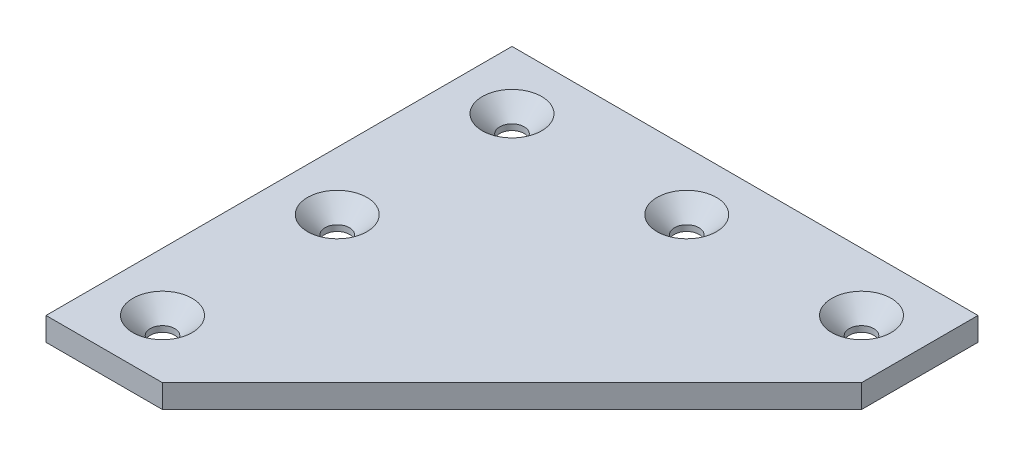
ISO-10303-21;
HEADER;
FILE_DESCRIPTION(('STEP AP214'),'2;1');
FILE_NAME('part.step','',(''),(''),'','','');
FILE_SCHEMA(('AUTOMOTIVE_DESIGN { 1 0 10303 214 1 1 1 1 }'));
ENDSEC;
DATA;
#1=APPLICATION_CONTEXT('core data for automotive mechanical design processes');
#2=APPLICATION_PROTOCOL_DEFINITION('international standard','automotive_design',2000,#1);
#3=PRODUCT_CONTEXT('',#1,'mechanical');
#4=PRODUCT('Part','Part','',(#3));
#5=PRODUCT_RELATED_PRODUCT_CATEGORY('part','',(#4));
#6=PRODUCT_DEFINITION_FORMATION('','',#4);
#7=PRODUCT_DEFINITION_CONTEXT('part definition',#1,'design');
#8=PRODUCT_DEFINITION('design','',#6,#7);
#9=PRODUCT_DEFINITION_SHAPE('','',#8);
#10=(LENGTH_UNIT() NAMED_UNIT(*) SI_UNIT(.MILLI.,.METRE.));
#11=(NAMED_UNIT(*) PLANE_ANGLE_UNIT() SI_UNIT($,.RADIAN.));
#12=(NAMED_UNIT(*) SI_UNIT($,.STERADIAN.) SOLID_ANGLE_UNIT());
#13=UNCERTAINTY_MEASURE_WITH_UNIT(LENGTH_MEASURE(1.E-05),#10,'distance_accuracy_value','');
#14=(GEOMETRIC_REPRESENTATION_CONTEXT(3) GLOBAL_UNCERTAINTY_ASSIGNED_CONTEXT((#13)) GLOBAL_UNIT_ASSIGNED_CONTEXT((#10,
#11,#12)) REPRESENTATION_CONTEXT('',''));
#15=CARTESIAN_POINT('',(0.,0.,0.));
#16=DIRECTION('',(0.,0.,1.));
#17=DIRECTION('',(1.,0.,0.));
#18=AXIS2_PLACEMENT_3D('',#15,#16,#17);
#19=CARTESIAN_POINT('',(80.,4.,0.));
#20=DIRECTION('',(0.,0.,1.));
#21=DIRECTION('',(-1.,0.,0.));
#22=AXIS2_PLACEMENT_3D('',#19,#20,#21);
#23=PLANE('',#22);
#24=DIRECTION('',(1.,0.,0.));
#25=VECTOR('',#24,1.);
#26=CARTESIAN_POINT('',(80.,0.,0.));
#27=LINE('',#26,#25);
#28=CARTESIAN_POINT('',(0.,0.,0.));
#29=VERTEX_POINT('',#28);
#30=CARTESIAN_POINT('',(80.,0.,0.));
#31=VERTEX_POINT('',#30);
#32=EDGE_CURVE('E118',#29,#31,#27,.T.);
#33=ORIENTED_EDGE('',*,*,#32,.F.);
#34=DIRECTION('',(0.,-1.,0.));
#35=VECTOR('',#34,1.);
#36=CARTESIAN_POINT('',(0.,4.,0.));
#37=LINE('',#36,#35);
#38=CARTESIAN_POINT('',(0.,4.,0.));
#39=VERTEX_POINT('',#38);
#40=EDGE_CURVE('E117',#39,#29,#37,.T.);
#41=ORIENTED_EDGE('',*,*,#40,.F.);
#42=DIRECTION('',(1.,0.,0.));
#43=VECTOR('',#42,1.);
#44=CARTESIAN_POINT('',(80.,4.,0.));
#45=LINE('',#44,#43);
#46=CARTESIAN_POINT('',(80.,4.,0.));
#47=VERTEX_POINT('',#46);
#48=EDGE_CURVE('E112',#39,#47,#45,.T.);
#49=ORIENTED_EDGE('',*,*,#48,.T.);
#50=DIRECTION('',(0.,-1.,0.));
#51=VECTOR('',#50,1.);
#52=CARTESIAN_POINT('',(80.,4.,0.));
#53=LINE('',#52,#51);
#54=EDGE_CURVE('E131',#47,#31,#53,.T.);
#55=ORIENTED_EDGE('',*,*,#54,.T.);
#56=EDGE_LOOP('',(#33,#41,#49,#55));
#57=FACE_BOUND('',#56,.T.);
#58=ADVANCED_FACE('F41',(#57),#23,.F.);
#59=CARTESIAN_POINT('',(80.,4.,20.));
#60=DIRECTION('',(-1.,0.,0.));
#61=DIRECTION('',(0.,0.,-1.));
#62=AXIS2_PLACEMENT_3D('',#59,#60,#61);
#63=PLANE('',#62);
#64=DIRECTION('',(0.,0.,1.));
#65=VECTOR('',#64,1.);
#66=CARTESIAN_POINT('',(80.,0.,20.));
#67=LINE('',#66,#65);
#68=CARTESIAN_POINT('',(80.,0.,20.));
#69=VERTEX_POINT('',#68);
#70=EDGE_CURVE('E120',#31,#69,#67,.T.);
#71=ORIENTED_EDGE('',*,*,#70,.F.);
#72=ORIENTED_EDGE('',*,*,#54,.F.);
#73=DIRECTION('',(0.,0.,1.));
#74=VECTOR('',#73,1.);
#75=CARTESIAN_POINT('',(80.,4.,20.));
#76=LINE('',#75,#74);
#77=CARTESIAN_POINT('',(80.,4.,20.));
#78=VERTEX_POINT('',#77);
#79=EDGE_CURVE('E87',#47,#78,#76,.T.);
#80=ORIENTED_EDGE('',*,*,#79,.T.);
#81=DIRECTION('',(0.,-1.,0.));
#82=VECTOR('',#81,1.);
#83=CARTESIAN_POINT('',(80.,4.,20.));
#84=LINE('',#83,#82);
#85=EDGE_CURVE('E106',#78,#69,#84,.T.);
#86=ORIENTED_EDGE('',*,*,#85,.T.);
#87=EDGE_LOOP('',(#71,#72,#80,#86));
#88=FACE_BOUND('',#87,.T.);
#89=ADVANCED_FACE('F200',(#88),#63,.F.);
#90=CARTESIAN_POINT('',(20.,4.,79.9999999999998));
#91=DIRECTION('',(-0.707106781186546,0.,-0.707106781186549));
#92=DIRECTION('',(0.707106781186549,0.,-0.707106781186546));
#93=AXIS2_PLACEMENT_3D('',#90,#91,#92);
#94=PLANE('',#93);
#95=DIRECTION('',(-0.707106781186549,0.,0.707106781186546));
#96=VECTOR('',#95,1.);
#97=CARTESIAN_POINT('',(20.,0.,79.9999999999998));
#98=LINE('',#97,#96);
#99=CARTESIAN_POINT('',(20.,0.,79.9999999999998));
#100=VERTEX_POINT('',#99);
#101=EDGE_CURVE('E124',#69,#100,#98,.T.);
#102=ORIENTED_EDGE('',*,*,#101,.F.);
#103=ORIENTED_EDGE('',*,*,#85,.F.);
#104=DIRECTION('',(-0.707106781186549,0.,0.707106781186546));
#105=VECTOR('',#104,1.);
#106=CARTESIAN_POINT('',(20.,4.,79.9999999999998));
#107=LINE('',#106,#105);
#108=CARTESIAN_POINT('',(20.,4.,79.9999999999998));
#109=VERTEX_POINT('',#108);
#110=EDGE_CURVE('E96',#78,#109,#107,.T.);
#111=ORIENTED_EDGE('',*,*,#110,.T.);
#112=DIRECTION('',(0.,-1.,0.));
#113=VECTOR('',#112,1.);
#114=CARTESIAN_POINT('',(20.,4.,79.9999999999998));
#115=LINE('',#114,#113);
#116=EDGE_CURVE('E101',#109,#100,#115,.T.);
#117=ORIENTED_EDGE('',*,*,#116,.T.);
#118=EDGE_LOOP('',(#102,#103,#111,#117));
#119=FACE_BOUND('',#118,.T.);
#120=ADVANCED_FACE('F109',(#119),#94,.F.);
#121=CARTESIAN_POINT('',(0.,4.,79.9999999999998));
#122=DIRECTION('',(0.,0.,-1.));
#123=DIRECTION('',(1.,0.,0.));
#124=AXIS2_PLACEMENT_3D('',#121,#122,#123);
#125=PLANE('',#124);
#126=DIRECTION('',(-1.,0.,0.));
#127=VECTOR('',#126,1.);
#128=CARTESIAN_POINT('',(0.,0.,79.9999999999998));
#129=LINE('',#128,#127);
#130=CARTESIAN_POINT('',(0.,0.,79.9999999999998));
#131=VERTEX_POINT('',#130);
#132=EDGE_CURVE('E103',#100,#131,#129,.T.);
#133=ORIENTED_EDGE('',*,*,#132,.F.);
#134=ORIENTED_EDGE('',*,*,#116,.F.);
#135=DIRECTION('',(-1.,0.,0.));
#136=VECTOR('',#135,1.);
#137=CARTESIAN_POINT('',(0.,4.,79.9999999999998));
#138=LINE('',#137,#136);
#139=CARTESIAN_POINT('',(0.,4.,79.9999999999998));
#140=VERTEX_POINT('',#139);
#141=EDGE_CURVE('E92',#109,#140,#138,.T.);
#142=ORIENTED_EDGE('',*,*,#141,.T.);
#143=DIRECTION('',(0.,-1.,0.));
#144=VECTOR('',#143,1.);
#145=CARTESIAN_POINT('',(0.,4.,79.9999999999998));
#146=LINE('',#145,#144);
#147=EDGE_CURVE('E107',#140,#131,#146,.T.);
#148=ORIENTED_EDGE('',*,*,#147,.T.);
#149=EDGE_LOOP('',(#133,#134,#142,#148));
#150=FACE_BOUND('',#149,.T.);
#151=ADVANCED_FACE('F102',(#150),#125,.F.);
#152=CARTESIAN_POINT('',(0.,4.,0.));
#153=DIRECTION('',(1.,0.,0.));
#154=DIRECTION('',(0.,0.,1.));
#155=AXIS2_PLACEMENT_3D('',#152,#153,#154);
#156=PLANE('',#155);
#157=DIRECTION('',(0.,0.,-1.));
#158=VECTOR('',#157,1.);
#159=CARTESIAN_POINT('',(0.,0.,0.));
#160=LINE('',#159,#158);
#161=EDGE_CURVE('E75',#131,#29,#160,.T.);
#162=ORIENTED_EDGE('',*,*,#161,.F.);
#163=ORIENTED_EDGE('',*,*,#147,.F.);
#164=DIRECTION('',(0.,0.,-1.));
#165=VECTOR('',#164,1.);
#166=CARTESIAN_POINT('',(0.,4.,0.));
#167=LINE('',#166,#165);
#168=EDGE_CURVE('E58',#140,#39,#167,.T.);
#169=ORIENTED_EDGE('',*,*,#168,.T.);
#170=ORIENTED_EDGE('',*,*,#40,.T.);
#171=EDGE_LOOP('',(#162,#163,#169,#170));
#172=FACE_BOUND('',#171,.T.);
#173=ADVANCED_FACE('F187',(#172),#156,.F.);
#174=CARTESIAN_POINT('',(0.,4.,0.));
#175=DIRECTION('',(0.,-1.,0.));
#176=DIRECTION('',(0.,0.,1.));
#177=AXIS2_PLACEMENT_3D('',#174,#175,#176);
#178=PLANE('',#177);
#179=CARTESIAN_POINT('',(70.,4.,10.));
#180=DIRECTION('',(0.,1.,0.));
#181=DIRECTION('',(0.,0.,1.));
#182=AXIS2_PLACEMENT_3D('',#179,#180,#181);
#183=CIRCLE('',#182,5.10000000000002);
#184=CARTESIAN_POINT('',(70.,4.,15.1));
#185=VERTEX_POINT('',#184);
#186=EDGE_CURVE('E149',#185,#185,#183,.T.);
#187=ORIENTED_EDGE('',*,*,#186,.F.);
#188=EDGE_LOOP('',(#187));
#189=FACE_BOUND('',#188,.T.);
#190=CARTESIAN_POINT('',(40.,4.,10.));
#191=DIRECTION('',(0.,1.,0.));
#192=DIRECTION('',(0.,0.,1.));
#193=AXIS2_PLACEMENT_3D('',#190,#191,#192);
#194=CIRCLE('',#193,5.10000000000001);
#195=CARTESIAN_POINT('',(40.,4.,15.1));
#196=VERTEX_POINT('',#195);
#197=EDGE_CURVE('E146',#196,#196,#194,.T.);
#198=ORIENTED_EDGE('',*,*,#197,.F.);
#199=EDGE_LOOP('',(#198));
#200=FACE_BOUND('',#199,.T.);
#201=CARTESIAN_POINT('',(10.,4.,10.));
#202=DIRECTION('',(0.,1.,0.));
#203=DIRECTION('',(0.,0.,1.));
#204=AXIS2_PLACEMENT_3D('',#201,#202,#203);
#205=CIRCLE('',#204,5.10000000000004);
#206=CARTESIAN_POINT('',(10.,4.,15.1));
#207=VERTEX_POINT('',#206);
#208=EDGE_CURVE('E143',#207,#207,#205,.T.);
#209=ORIENTED_EDGE('',*,*,#208,.F.);
#210=EDGE_LOOP('',(#209));
#211=FACE_BOUND('',#210,.T.);
#212=CARTESIAN_POINT('',(9.9999999999999,4.,40.));
#213=DIRECTION('',(0.,1.,0.));
#214=DIRECTION('',(0.,0.,1.));
#215=AXIS2_PLACEMENT_3D('',#212,#213,#214);
#216=CIRCLE('',#215,5.10000000000002);
#217=CARTESIAN_POINT('',(9.9999999999999,4.,45.1));
#218=VERTEX_POINT('',#217);
#219=EDGE_CURVE('E140',#218,#218,#216,.T.);
#220=ORIENTED_EDGE('',*,*,#219,.F.);
#221=EDGE_LOOP('',(#220));
#222=FACE_BOUND('',#221,.T.);
#223=CARTESIAN_POINT('',(9.99999999999979,4.,70.));
#224=DIRECTION('',(0.,1.,0.));
#225=DIRECTION('',(0.,0.,1.));
#226=AXIS2_PLACEMENT_3D('',#223,#224,#225);
#227=CIRCLE('',#226,5.10000000000001);
#228=CARTESIAN_POINT('',(9.99999999999979,4.,64.9));
#229=VERTEX_POINT('',#228);
#230=EDGE_CURVE('E137',#229,#229,#227,.T.);
#231=ORIENTED_EDGE('',*,*,#230,.F.);
#232=EDGE_LOOP('',(#231));
#233=FACE_BOUND('',#232,.T.);
#234=ORIENTED_EDGE('',*,*,#48,.F.);
#235=ORIENTED_EDGE('',*,*,#168,.F.);
#236=ORIENTED_EDGE('',*,*,#141,.F.);
#237=ORIENTED_EDGE('',*,*,#110,.F.);
#238=ORIENTED_EDGE('',*,*,#79,.F.);
#239=EDGE_LOOP('',(#234,#235,#236,#237,#238));
#240=FACE_BOUND('',#239,.T.);
#241=ADVANCED_FACE('F94',(#189,#200,#211,#222,#233,#240),#178,.F.);
#242=CARTESIAN_POINT('',(0.,0.,0.));
#243=DIRECTION('',(0.,-1.,0.));
#244=DIRECTION('',(0.,0.,1.));
#245=AXIS2_PLACEMENT_3D('',#242,#243,#244);
#246=PLANE('',#245);
#247=CARTESIAN_POINT('',(9.99999999999979,0.,70.));
#248=DIRECTION('',(0.,-1.,0.));
#249=DIRECTION('',(0.,0.,-1.));
#250=AXIS2_PLACEMENT_3D('',#247,#248,#249);
#251=CIRCLE('',#250,2.1);
#252=CARTESIAN_POINT('',(9.99999999999979,0.,67.9));
#253=VERTEX_POINT('',#252);
#254=EDGE_CURVE('E173',#253,#253,#251,.T.);
#255=ORIENTED_EDGE('',*,*,#254,.F.);
#256=EDGE_LOOP('',(#255));
#257=FACE_BOUND('',#256,.T.);
#258=CARTESIAN_POINT('',(9.9999999999999,0.,40.));
#259=DIRECTION('',(0.,-1.,0.));
#260=DIRECTION('',(0.,0.,-1.));
#261=AXIS2_PLACEMENT_3D('',#258,#259,#260);
#262=CIRCLE('',#261,2.1);
#263=CARTESIAN_POINT('',(9.9999999999999,0.,37.9));
#264=VERTEX_POINT('',#263);
#265=EDGE_CURVE('E170',#264,#264,#262,.T.);
#266=ORIENTED_EDGE('',*,*,#265,.F.);
#267=EDGE_LOOP('',(#266));
#268=FACE_BOUND('',#267,.T.);
#269=CARTESIAN_POINT('',(70.,0.,10.));
#270=DIRECTION('',(0.,-1.,0.));
#271=DIRECTION('',(0.,0.,-1.));
#272=AXIS2_PLACEMENT_3D('',#269,#270,#271);
#273=CIRCLE('',#272,2.1);
#274=CARTESIAN_POINT('',(70.,0.,7.9));
#275=VERTEX_POINT('',#274);
#276=EDGE_CURVE('E172',#275,#275,#273,.T.);
#277=ORIENTED_EDGE('',*,*,#276,.F.);
#278=EDGE_LOOP('',(#277));
#279=FACE_BOUND('',#278,.T.);
#280=CARTESIAN_POINT('',(10.,0.,10.));
#281=DIRECTION('',(0.,-1.,0.));
#282=DIRECTION('',(0.,0.,-1.));
#283=AXIS2_PLACEMENT_3D('',#280,#281,#282);
#284=CIRCLE('',#283,2.1);
#285=CARTESIAN_POINT('',(10.,0.,7.9));
#286=VERTEX_POINT('',#285);
#287=EDGE_CURVE('E176',#286,#286,#284,.T.);
#288=ORIENTED_EDGE('',*,*,#287,.F.);
#289=EDGE_LOOP('',(#288));
#290=FACE_BOUND('',#289,.T.);
#291=CARTESIAN_POINT('',(40.,0.,10.));
#292=DIRECTION('',(0.,-1.,0.));
#293=DIRECTION('',(0.,0.,-1.));
#294=AXIS2_PLACEMENT_3D('',#291,#292,#293);
#295=CIRCLE('',#294,2.1);
#296=CARTESIAN_POINT('',(40.,0.,7.9));
#297=VERTEX_POINT('',#296);
#298=EDGE_CURVE('E121',#297,#297,#295,.T.);
#299=ORIENTED_EDGE('',*,*,#298,.F.);
#300=EDGE_LOOP('',(#299));
#301=FACE_BOUND('',#300,.T.);
#302=ORIENTED_EDGE('',*,*,#32,.T.);
#303=ORIENTED_EDGE('',*,*,#70,.T.);
#304=ORIENTED_EDGE('',*,*,#101,.T.);
#305=ORIENTED_EDGE('',*,*,#132,.T.);
#306=ORIENTED_EDGE('',*,*,#161,.T.);
#307=EDGE_LOOP('',(#302,#303,#304,#305,#306));
#308=FACE_BOUND('',#307,.T.);
#309=ADVANCED_FACE('F194',(#257,#268,#279,#290,#301,#308),#246,.T.);
#310=CARTESIAN_POINT('',(40.,0.,10.));
#311=DIRECTION('',(0.,1.,0.));
#312=DIRECTION('',(0.,0.,-1.));
#313=AXIS2_PLACEMENT_3D('',#310,#311,#312);
#314=CYLINDRICAL_SURFACE('',#313,2.1);
#315=CARTESIAN_POINT('',(40.,0.999999999999996,10.));
#316=DIRECTION('',(0.,1.,0.));
#317=DIRECTION('',(0.,0.,1.));
#318=AXIS2_PLACEMENT_3D('',#315,#316,#317);
#319=CIRCLE('',#318,2.1);
#320=CARTESIAN_POINT('',(40.,0.999999999999996,12.1));
#321=VERTEX_POINT('',#320);
#322=EDGE_CURVE('E152',#321,#321,#319,.F.);
#323=ORIENTED_EDGE('',*,*,#322,.F.);
#324=EDGE_LOOP('',(#323));
#325=FACE_BOUND('',#324,.T.);
#326=ORIENTED_EDGE('',*,*,#298,.T.);
#327=EDGE_LOOP('',(#326));
#328=FACE_BOUND('',#327,.T.);
#329=ADVANCED_FACE('F239',(#325,#328),#314,.F.);
#330=CARTESIAN_POINT('',(10.,0.,10.));
#331=DIRECTION('',(0.,1.,0.));
#332=DIRECTION('',(0.,0.,-1.));
#333=AXIS2_PLACEMENT_3D('',#330,#331,#332);
#334=CYLINDRICAL_SURFACE('',#333,2.1);
#335=CARTESIAN_POINT('',(10.,0.99999999999997,10.));
#336=DIRECTION('',(0.,1.,0.));
#337=DIRECTION('',(0.,0.,1.));
#338=AXIS2_PLACEMENT_3D('',#335,#336,#337);
#339=CIRCLE('',#338,2.1);
#340=CARTESIAN_POINT('',(10.,0.99999999999997,12.1));
#341=VERTEX_POINT('',#340);
#342=EDGE_CURVE('E155',#341,#341,#339,.F.);
#343=ORIENTED_EDGE('',*,*,#342,.F.);
#344=EDGE_LOOP('',(#343));
#345=FACE_BOUND('',#344,.T.);
#346=ORIENTED_EDGE('',*,*,#287,.T.);
#347=EDGE_LOOP('',(#346));
#348=FACE_BOUND('',#347,.T.);
#349=ADVANCED_FACE('F249',(#345,#348),#334,.F.);
#350=CARTESIAN_POINT('',(70.,0.,10.));
#351=DIRECTION('',(0.,1.,0.));
#352=DIRECTION('',(0.,0.,-1.));
#353=AXIS2_PLACEMENT_3D('',#350,#351,#352);
#354=CYLINDRICAL_SURFACE('',#353,2.1);
#355=CARTESIAN_POINT('',(70.,0.99999999999999,10.));
#356=DIRECTION('',(0.,1.,0.));
#357=DIRECTION('',(0.,0.,1.));
#358=AXIS2_PLACEMENT_3D('',#355,#356,#357);
#359=CIRCLE('',#358,2.1);
#360=CARTESIAN_POINT('',(70.,0.99999999999999,12.1));
#361=VERTEX_POINT('',#360);
#362=EDGE_CURVE('E134',#361,#361,#359,.F.);
#363=ORIENTED_EDGE('',*,*,#362,.F.);
#364=EDGE_LOOP('',(#363));
#365=FACE_BOUND('',#364,.T.);
#366=ORIENTED_EDGE('',*,*,#276,.T.);
#367=EDGE_LOOP('',(#366));
#368=FACE_BOUND('',#367,.T.);
#369=ADVANCED_FACE('F166',(#365,#368),#354,.F.);
#370=CARTESIAN_POINT('',(9.9999999999999,0.,40.));
#371=DIRECTION('',(0.,1.,0.));
#372=DIRECTION('',(0.,0.,-1.));
#373=AXIS2_PLACEMENT_3D('',#370,#371,#372);
#374=CYLINDRICAL_SURFACE('',#373,2.1);
#375=CARTESIAN_POINT('',(9.9999999999999,0.999999999999983,40.));
#376=DIRECTION('',(0.,1.,0.));
#377=DIRECTION('',(0.,0.,1.));
#378=AXIS2_PLACEMENT_3D('',#375,#376,#377);
#379=CIRCLE('',#378,2.1);
#380=CARTESIAN_POINT('',(9.9999999999999,0.999999999999983,42.1));
#381=VERTEX_POINT('',#380);
#382=EDGE_CURVE('E50',#381,#381,#379,.F.);
#383=ORIENTED_EDGE('',*,*,#382,.F.);
#384=EDGE_LOOP('',(#383));
#385=FACE_BOUND('',#384,.T.);
#386=ORIENTED_EDGE('',*,*,#265,.T.);
#387=EDGE_LOOP('',(#386));
#388=FACE_BOUND('',#387,.T.);
#389=ADVANCED_FACE('F162',(#385,#388),#374,.F.);
#390=CARTESIAN_POINT('',(9.99999999999979,0.,70.));
#391=DIRECTION('',(0.,1.,0.));
#392=DIRECTION('',(0.,0.,-1.));
#393=AXIS2_PLACEMENT_3D('',#390,#391,#392);
#394=CYLINDRICAL_SURFACE('',#393,2.1);
#395=CARTESIAN_POINT('',(9.99999999999979,1.,70.));
#396=DIRECTION('',(0.,1.,0.));
#397=DIRECTION('',(0.,0.,1.));
#398=AXIS2_PLACEMENT_3D('',#395,#396,#397);
#399=CIRCLE('',#398,2.1);
#400=CARTESIAN_POINT('',(9.99999999999979,0.999999999999999,67.9));
#401=VERTEX_POINT('',#400);
#402=EDGE_CURVE('E11',#401,#401,#399,.F.);
#403=ORIENTED_EDGE('',*,*,#402,.F.);
#404=EDGE_LOOP('',(#403));
#405=FACE_BOUND('',#404,.T.);
#406=ORIENTED_EDGE('',*,*,#254,.T.);
#407=EDGE_LOOP('',(#406));
#408=FACE_BOUND('',#407,.T.);
#409=ADVANCED_FACE('F165',(#405,#408),#394,.F.);
#410=CARTESIAN_POINT('',(70.,0.99999999999999,10.));
#411=DIRECTION('',(0.,1.,0.));
#412=DIRECTION('',(0.,0.,-1.));
#413=AXIS2_PLACEMENT_3D('',#410,#411,#412);
#414=CONICAL_SURFACE('',#413,2.1,0.785398163397449);
#415=ORIENTED_EDGE('',*,*,#186,.T.);
#416=EDGE_LOOP('',(#415));
#417=FACE_BOUND('',#416,.T.);
#418=ORIENTED_EDGE('',*,*,#362,.T.);
#419=EDGE_LOOP('',(#418));
#420=FACE_BOUND('',#419,.T.);
#421=ADVANCED_FACE('F209',(#417,#420),#414,.F.);
#422=CARTESIAN_POINT('',(40.,0.999999999999996,10.));
#423=DIRECTION('',(0.,1.,0.));
#424=DIRECTION('',(0.,0.,-1.));
#425=AXIS2_PLACEMENT_3D('',#422,#423,#424);
#426=CONICAL_SURFACE('',#425,2.1,0.785398163397449);
#427=ORIENTED_EDGE('',*,*,#197,.T.);
#428=EDGE_LOOP('',(#427));
#429=FACE_BOUND('',#428,.T.);
#430=ORIENTED_EDGE('',*,*,#322,.T.);
#431=EDGE_LOOP('',(#430));
#432=FACE_BOUND('',#431,.T.);
#433=ADVANCED_FACE('F212',(#429,#432),#426,.F.);
#434=CARTESIAN_POINT('',(10.,0.99999999999997,10.));
#435=DIRECTION('',(0.,1.,0.));
#436=DIRECTION('',(0.,0.,-1.));
#437=AXIS2_PLACEMENT_3D('',#434,#435,#436);
#438=CONICAL_SURFACE('',#437,2.1,0.78539816339745);
#439=ORIENTED_EDGE('',*,*,#208,.T.);
#440=EDGE_LOOP('',(#439));
#441=FACE_BOUND('',#440,.T.);
#442=ORIENTED_EDGE('',*,*,#342,.T.);
#443=EDGE_LOOP('',(#442));
#444=FACE_BOUND('',#443,.T.);
#445=ADVANCED_FACE('F216',(#441,#444),#438,.F.);
#446=CARTESIAN_POINT('',(9.9999999999999,0.999999999999984,40.));
#447=DIRECTION('',(0.,1.,0.));
#448=DIRECTION('',(0.,0.,-1.));
#449=AXIS2_PLACEMENT_3D('',#446,#447,#448);
#450=CONICAL_SURFACE('',#449,2.1,0.785398163397449);
#451=ORIENTED_EDGE('',*,*,#219,.T.);
#452=EDGE_LOOP('',(#451));
#453=FACE_BOUND('',#452,.T.);
#454=ORIENTED_EDGE('',*,*,#382,.T.);
#455=EDGE_LOOP('',(#454));
#456=FACE_BOUND('',#455,.T.);
#457=ADVANCED_FACE('F160',(#453,#456),#450,.F.);
#458=CARTESIAN_POINT('',(9.99999999999979,1.,70.));
#459=DIRECTION('',(0.,1.,0.));
#460=DIRECTION('',(0.,0.,-1.));
#461=AXIS2_PLACEMENT_3D('',#458,#459,#460);
#462=CONICAL_SURFACE('',#461,2.1,0.785398163397449);
#463=CARTESIAN_POINT('',(9.99999999999979,4.,64.9));
#464=CARTESIAN_POINT('',(9.99999999999979,3.96875,64.93125));
#465=CARTESIAN_POINT('',(9.99999999999979,3.9375,64.9625));
#466=CARTESIAN_POINT('',(9.99999999999979,3.875,65.025));
#467=CARTESIAN_POINT('',(9.99999999999979,3.84375,65.05625));
#468=CARTESIAN_POINT('',(9.99999999999979,3.78125,65.11875));
#469=CARTESIAN_POINT('',(9.99999999999979,3.75,65.15));
#470=CARTESIAN_POINT('',(9.99999999999979,3.6875,65.2125));
#471=CARTESIAN_POINT('',(9.99999999999979,3.65625,65.24375));
#472=CARTESIAN_POINT('',(9.99999999999979,3.59375,65.30625));
#473=CARTESIAN_POINT('',(9.99999999999979,3.5625,65.3375));
#474=CARTESIAN_POINT('',(9.99999999999979,3.5,65.4));
#475=CARTESIAN_POINT('',(9.99999999999979,3.46875,65.43125));
#476=CARTESIAN_POINT('',(9.99999999999979,3.40625,65.49375));
#477=CARTESIAN_POINT('',(9.99999999999979,3.375,65.525));
#478=CARTESIAN_POINT('',(9.99999999999979,3.3125,65.5875));
#479=CARTESIAN_POINT('',(9.99999999999979,3.28125,65.61875));
#480=CARTESIAN_POINT('',(9.99999999999979,3.21875,65.68125));
#481=CARTESIAN_POINT('',(9.99999999999979,3.1875,65.7125));
#482=CARTESIAN_POINT('',(9.99999999999979,3.125,65.775));
#483=CARTESIAN_POINT('',(9.99999999999979,3.09375,65.80625));
#484=CARTESIAN_POINT('',(9.99999999999979,3.03125,65.86875));
#485=CARTESIAN_POINT('',(9.99999999999979,3.,65.9));
#486=CARTESIAN_POINT('',(9.99999999999979,2.9375,65.9625));
#487=CARTESIAN_POINT('',(9.99999999999979,2.90625,65.99375));
#488=CARTESIAN_POINT('',(9.99999999999979,2.84375,66.05625));
#489=CARTESIAN_POINT('',(9.99999999999979,2.8125,66.0875));
#490=CARTESIAN_POINT('',(9.99999999999979,2.75,66.15));
#491=CARTESIAN_POINT('',(9.99999999999979,2.71875,66.18125));
#492=CARTESIAN_POINT('',(9.99999999999979,2.65625,66.24375));
#493=CARTESIAN_POINT('',(9.99999999999979,2.625,66.275));
#494=CARTESIAN_POINT('',(9.99999999999979,2.5625,66.3375));
#495=CARTESIAN_POINT('',(9.99999999999979,2.53125,66.36875));
#496=CARTESIAN_POINT('',(9.99999999999979,2.46875,66.43125));
#497=CARTESIAN_POINT('',(9.99999999999979,2.4375,66.4625));
#498=CARTESIAN_POINT('',(9.99999999999979,2.375,66.525));
#499=CARTESIAN_POINT('',(9.99999999999979,2.34375,66.55625));
#500=CARTESIAN_POINT('',(9.99999999999979,2.28125,66.61875));
#501=CARTESIAN_POINT('',(9.99999999999979,2.25,66.65));
#502=CARTESIAN_POINT('',(9.99999999999979,2.1875,66.7125));
#503=CARTESIAN_POINT('',(9.99999999999979,2.15625,66.74375));
#504=CARTESIAN_POINT('',(9.99999999999979,2.09375,66.80625));
#505=CARTESIAN_POINT('',(9.99999999999979,2.0625,66.8375));
#506=CARTESIAN_POINT('',(9.99999999999979,2.,66.9));
#507=CARTESIAN_POINT('',(9.99999999999979,1.96875,66.93125));
#508=CARTESIAN_POINT('',(9.99999999999979,1.90625,66.99375));
#509=CARTESIAN_POINT('',(9.99999999999979,1.875,67.025));
#510=CARTESIAN_POINT('',(9.99999999999979,1.8125,67.0875));
#511=CARTESIAN_POINT('',(9.99999999999979,1.78125,67.11875));
#512=CARTESIAN_POINT('',(9.99999999999979,1.71875,67.18125));
#513=CARTESIAN_POINT('',(9.99999999999979,1.6875,67.2125));
#514=CARTESIAN_POINT('',(9.99999999999979,1.625,67.275));
#515=CARTESIAN_POINT('',(9.99999999999979,1.59375,67.30625));
#516=CARTESIAN_POINT('',(9.99999999999979,1.53125,67.36875));
#517=CARTESIAN_POINT('',(9.99999999999979,1.5,67.4));
#518=CARTESIAN_POINT('',(9.99999999999979,1.4375,67.4625));
#519=CARTESIAN_POINT('',(9.99999999999979,1.40625,67.49375));
#520=CARTESIAN_POINT('',(9.99999999999979,1.34375,67.55625));
#521=CARTESIAN_POINT('',(9.99999999999979,1.3125,67.5875));
#522=CARTESIAN_POINT('',(9.99999999999979,1.25,67.65));
#523=CARTESIAN_POINT('',(9.99999999999979,1.21875,67.68125));
#524=CARTESIAN_POINT('',(9.99999999999979,1.15625,67.74375));
#525=CARTESIAN_POINT('',(9.99999999999979,1.125,67.775));
#526=CARTESIAN_POINT('',(9.99999999999979,1.0625,67.8375));
#527=CARTESIAN_POINT('',(9.99999999999979,1.03125,67.86875));
#528=CARTESIAN_POINT('',(9.99999999999979,1.,67.9));
#529=B_SPLINE_CURVE_WITH_KNOTS('',3,(#463,#464,#465,#466,#467,#468,#469,#470,#471,#472,#473,
#474,#475,#476,#477,#478,#479,#480,#481,#482,#483,#484,#485,#486,#487,#488,#489,#490,#491,#492,
#493,#494,#495,#496,#497,#498,#499,#500,#501,#502,#503,#504,#505,#506,#507,#508,#509,#510,#511,
#512,#513,#514,#515,#516,#517,#518,#519,#520,#521,#522,#523,#524,#525,#526,#527,#528),
.UNSPECIFIED.,.F.,.F.,(4,2,2,2,2,2,2,2,2,2,2,2,2,2,2,2,2,2,2,2,2,2,2,2,2,2,2,2,2,2,2,2,4),(0.,
0.13258252147248,0.26516504294496,0.397747564417431,0.530330085889911,0.662912607362391,
0.795495128834871,0.928077650307342,1.06066017177982,1.1932426932523,1.32582521472478,
1.45840773619725,1.59099025766973,1.72357277914221,1.85615530061469,1.98873782208716,
2.12132034355964,2.25390286503212,2.3864853865046,2.51906790797707,2.65165042944955,
2.78423295092203,2.91681547239451,3.04939799386698,3.18198051533946,3.31456303681194,
3.44714555828442,3.5797280797569,3.71231060122938,3.84489312270186,3.97747564417434,
4.11005816564682,4.24264068711929),.UNSPECIFIED.);
#530=EDGE_CURVE('BSEAM43',#229,#401,#529,.T.);
#531=ORIENTED_EDGE('',*,*,#230,.T.);
#532=ORIENTED_EDGE('',*,*,#402,.T.);
#533=ORIENTED_EDGE('',*,*,#530,.T.);
#534=ORIENTED_EDGE('',*,*,#530,.F.);
#535=EDGE_LOOP('',(#531,#533,#532,#534));
#536=FACE_BOUND('',#535,.T.);
#537=ADVANCED_FACE('F43',(#536),#462,.F.);
#538=CLOSED_SHELL('',(#58,#89,#120,#151,#173,#241,#309,#329,#349,#369,#389,#409,#421,#433,#445,
#457,#537));
#539=MANIFOLD_SOLID_BREP('B2',#538);
#540=ADVANCED_BREP_SHAPE_REPRESENTATION('',(#18,#539),#14);
#541=SHAPE_DEFINITION_REPRESENTATION(#9,#540);
ENDSEC;
END-ISO-10303-21;
